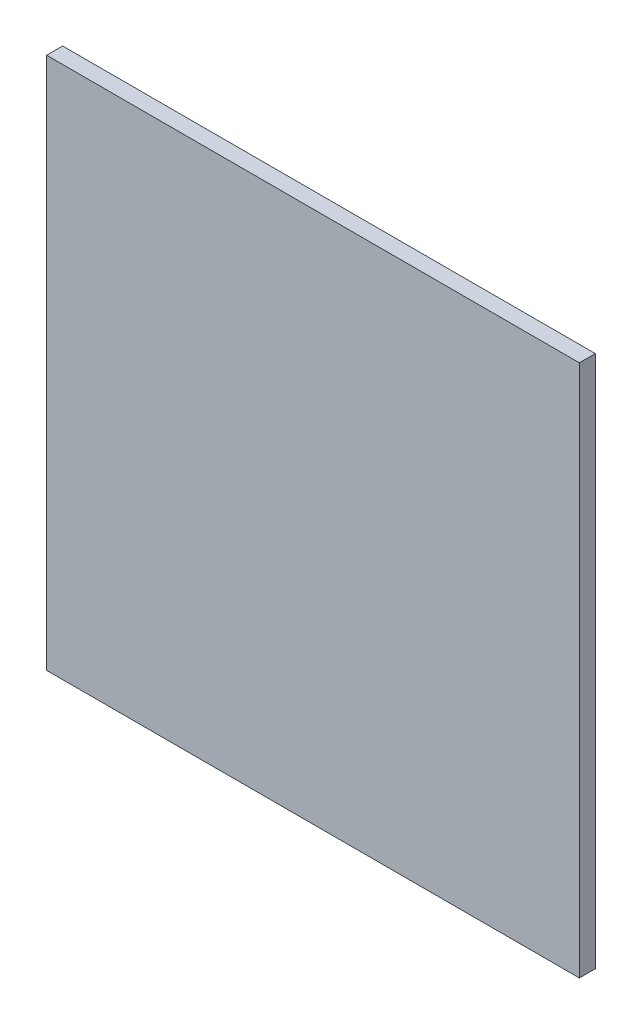
ISO-10303-21;
HEADER;
FILE_DESCRIPTION(('STEP AP214'),'2;1');
FILE_NAME('part.step','',(''),(''),'','','');
FILE_SCHEMA(('AUTOMOTIVE_DESIGN { 1 0 10303 214 1 1 1 1 }'));
ENDSEC;
DATA;
#1=APPLICATION_CONTEXT('core data for automotive mechanical design processes');
#2=APPLICATION_PROTOCOL_DEFINITION('international standard','automotive_design',2000,#1);
#3=PRODUCT_CONTEXT('',#1,'mechanical');
#4=PRODUCT('Part','Part','',(#3));
#5=PRODUCT_RELATED_PRODUCT_CATEGORY('part','',(#4));
#6=PRODUCT_DEFINITION_FORMATION('','',#4);
#7=PRODUCT_DEFINITION_CONTEXT('part definition',#1,'design');
#8=PRODUCT_DEFINITION('design','',#6,#7);
#9=PRODUCT_DEFINITION_SHAPE('','',#8);
#10=(LENGTH_UNIT() NAMED_UNIT(*) SI_UNIT(.MILLI.,.METRE.));
#11=(NAMED_UNIT(*) PLANE_ANGLE_UNIT() SI_UNIT($,.RADIAN.));
#12=(NAMED_UNIT(*) SI_UNIT($,.STERADIAN.) SOLID_ANGLE_UNIT());
#13=UNCERTAINTY_MEASURE_WITH_UNIT(LENGTH_MEASURE(1.E-05),#10,'distance_accuracy_value','');
#14=(GEOMETRIC_REPRESENTATION_CONTEXT(3) GLOBAL_UNCERTAINTY_ASSIGNED_CONTEXT((#13)) GLOBAL_UNIT_ASSIGNED_CONTEXT((#10,
#11,#12)) REPRESENTATION_CONTEXT('',''));
#15=CARTESIAN_POINT('',(0.,0.,0.));
#16=DIRECTION('',(0.,0.,1.));
#17=DIRECTION('',(1.,0.,0.));
#18=AXIS2_PLACEMENT_3D('',#15,#16,#17);
#19=CARTESIAN_POINT('',(-0.851,-0.851,0.));
#20=DIRECTION('',(0.,-1.,0.));
#21=DIRECTION('',(0.,0.,-1.));
#22=AXIS2_PLACEMENT_3D('',#19,#20,#21);
#23=PLANE('',#22);
#24=DIRECTION('',(-1.,0.,0.));
#25=VECTOR('',#24,1.);
#26=CARTESIAN_POINT('',(0.851,-0.851,0.));
#27=LINE('',#26,#25);
#28=CARTESIAN_POINT('',(0.851,-0.851,0.));
#29=VERTEX_POINT('',#28);
#30=CARTESIAN_POINT('',(-0.851,-0.851,0.));
#31=VERTEX_POINT('',#30);
#32=EDGE_CURVE('E11',#29,#31,#27,.T.);
#33=ORIENTED_EDGE('',*,*,#32,.F.);
#34=DIRECTION('',(0.,0.,-1.));
#35=VECTOR('',#34,1.);
#36=CARTESIAN_POINT('',(0.851,-0.851,0.051));
#37=LINE('',#36,#35);
#38=CARTESIAN_POINT('',(0.851,-0.851,0.051));
#39=VERTEX_POINT('',#38);
#40=EDGE_CURVE('E24',#39,#29,#37,.T.);
#41=ORIENTED_EDGE('',*,*,#40,.F.);
#42=DIRECTION('',(1.,0.,0.));
#43=VECTOR('',#42,1.);
#44=CARTESIAN_POINT('',(-0.851,-0.851,0.051));
#45=LINE('',#44,#43);
#46=CARTESIAN_POINT('',(-0.851,-0.851,0.051));
#47=VERTEX_POINT('',#46);
#48=EDGE_CURVE('E88',#47,#39,#45,.T.);
#49=ORIENTED_EDGE('',*,*,#48,.F.);
#50=DIRECTION('',(0.,0.,1.));
#51=VECTOR('',#50,1.);
#52=CARTESIAN_POINT('',(-0.851,-0.851,0.));
#53=LINE('',#52,#51);
#54=EDGE_CURVE('E77',#31,#47,#53,.T.);
#55=ORIENTED_EDGE('',*,*,#54,.F.);
#56=EDGE_LOOP('',(#33,#41,#49,#55));
#57=FACE_BOUND('',#56,.T.);
#58=ADVANCED_FACE('F17',(#57),#23,.T.);
#59=CARTESIAN_POINT('',(0.851,-0.851,0.));
#60=DIRECTION('',(1.,0.,0.));
#61=DIRECTION('',(0.,1.,0.));
#62=AXIS2_PLACEMENT_3D('',#59,#60,#61);
#63=PLANE('',#62);
#64=DIRECTION('',(0.,-1.,0.));
#65=VECTOR('',#64,1.);
#66=CARTESIAN_POINT('',(0.851,0.851,0.));
#67=LINE('',#66,#65);
#68=CARTESIAN_POINT('',(0.851,0.851,0.));
#69=VERTEX_POINT('',#68);
#70=EDGE_CURVE('E85',#69,#29,#67,.T.);
#71=ORIENTED_EDGE('',*,*,#70,.F.);
#72=DIRECTION('',(0.,0.,-1.));
#73=VECTOR('',#72,1.);
#74=CARTESIAN_POINT('',(0.851,0.851,0.051));
#75=LINE('',#74,#73);
#76=CARTESIAN_POINT('',(0.851,0.851,0.051));
#77=VERTEX_POINT('',#76);
#78=EDGE_CURVE('E83',#77,#69,#75,.T.);
#79=ORIENTED_EDGE('',*,*,#78,.F.);
#80=DIRECTION('',(0.,1.,0.));
#81=VECTOR('',#80,1.);
#82=CARTESIAN_POINT('',(0.851,-0.851,0.051));
#83=LINE('',#82,#81);
#84=EDGE_CURVE('E72',#39,#77,#83,.T.);
#85=ORIENTED_EDGE('',*,*,#84,.F.);
#86=ORIENTED_EDGE('',*,*,#40,.T.);
#87=EDGE_LOOP('',(#71,#79,#85,#86));
#88=FACE_BOUND('',#87,.T.);
#89=ADVANCED_FACE('F90',(#88),#63,.T.);
#90=CARTESIAN_POINT('',(0.851,0.851,0.));
#91=DIRECTION('',(0.,1.,0.));
#92=DIRECTION('',(1.,0.,0.));
#93=AXIS2_PLACEMENT_3D('',#90,#91,#92);
#94=PLANE('',#93);
#95=DIRECTION('',(1.,0.,0.));
#96=VECTOR('',#95,1.);
#97=CARTESIAN_POINT('',(-0.851,0.851,0.));
#98=LINE('',#97,#96);
#99=CARTESIAN_POINT('',(-0.851,0.851,0.));
#100=VERTEX_POINT('',#99);
#101=EDGE_CURVE('E60',#100,#69,#98,.T.);
#102=ORIENTED_EDGE('',*,*,#101,.F.);
#103=DIRECTION('',(0.,0.,-1.));
#104=VECTOR('',#103,1.);
#105=CARTESIAN_POINT('',(-0.851,0.851,0.051));
#106=LINE('',#105,#104);
#107=CARTESIAN_POINT('',(-0.851,0.851,0.051));
#108=VERTEX_POINT('',#107);
#109=EDGE_CURVE('E54',#108,#100,#106,.T.);
#110=ORIENTED_EDGE('',*,*,#109,.F.);
#111=DIRECTION('',(-1.,0.,0.));
#112=VECTOR('',#111,1.);
#113=CARTESIAN_POINT('',(0.851,0.851,0.051));
#114=LINE('',#113,#112);
#115=EDGE_CURVE('E58',#77,#108,#114,.T.);
#116=ORIENTED_EDGE('',*,*,#115,.F.);
#117=ORIENTED_EDGE('',*,*,#78,.T.);
#118=EDGE_LOOP('',(#102,#110,#116,#117));
#119=FACE_BOUND('',#118,.T.);
#120=ADVANCED_FACE('F56',(#119),#94,.T.);
#121=CARTESIAN_POINT('',(-0.851,0.851,0.));
#122=DIRECTION('',(-1.,0.,0.));
#123=DIRECTION('',(0.,0.,1.));
#124=AXIS2_PLACEMENT_3D('',#121,#122,#123);
#125=PLANE('',#124);
#126=DIRECTION('',(0.,1.,0.));
#127=VECTOR('',#126,1.);
#128=CARTESIAN_POINT('',(-0.851,-0.851,0.));
#129=LINE('',#128,#127);
#130=EDGE_CURVE('E73',#31,#100,#129,.T.);
#131=ORIENTED_EDGE('',*,*,#130,.F.);
#132=ORIENTED_EDGE('',*,*,#54,.T.);
#133=DIRECTION('',(0.,-1.,0.));
#134=VECTOR('',#133,1.);
#135=CARTESIAN_POINT('',(-0.851,0.851,0.051));
#136=LINE('',#135,#134);
#137=EDGE_CURVE('E70',#108,#47,#136,.T.);
#138=ORIENTED_EDGE('',*,*,#137,.F.);
#139=ORIENTED_EDGE('',*,*,#109,.T.);
#140=EDGE_LOOP('',(#131,#132,#138,#139));
#141=FACE_BOUND('',#140,.T.);
#142=ADVANCED_FACE('F76',(#141),#125,.T.);
#143=CARTESIAN_POINT('',(-0.851,0.851,0.));
#144=DIRECTION('',(0.,0.,-1.));
#145=DIRECTION('',(0.,-1.,0.));
#146=AXIS2_PLACEMENT_3D('',#143,#144,#145);
#147=PLANE('',#146);
#148=ORIENTED_EDGE('',*,*,#101,.T.);
#149=ORIENTED_EDGE('',*,*,#70,.T.);
#150=ORIENTED_EDGE('',*,*,#32,.T.);
#151=ORIENTED_EDGE('',*,*,#130,.T.);
#152=EDGE_LOOP('',(#148,#149,#150,#151));
#153=FACE_BOUND('',#152,.T.);
#154=ADVANCED_FACE('F91',(#153),#147,.T.);
#155=CARTESIAN_POINT('',(-0.851,-0.851,0.051));
#156=DIRECTION('',(0.,0.,1.));
#157=DIRECTION('',(1.,0.,0.));
#158=AXIS2_PLACEMENT_3D('',#155,#156,#157);
#159=PLANE('',#158);
#160=ORIENTED_EDGE('',*,*,#48,.T.);
#161=ORIENTED_EDGE('',*,*,#84,.T.);
#162=ORIENTED_EDGE('',*,*,#115,.T.);
#163=ORIENTED_EDGE('',*,*,#137,.T.);
#164=EDGE_LOOP('',(#160,#161,#162,#163));
#165=FACE_BOUND('',#164,.T.);
#166=ADVANCED_FACE('F69',(#165),#159,.T.);
#167=CLOSED_SHELL('',(#58,#89,#120,#142,#154,#166));
#168=MANIFOLD_SOLID_BREP('B1',#167);
#169=ADVANCED_BREP_SHAPE_REPRESENTATION('',(#18,#168),#14);
#170=SHAPE_DEFINITION_REPRESENTATION(#9,#169);
ENDSEC;
END-ISO-10303-21;
